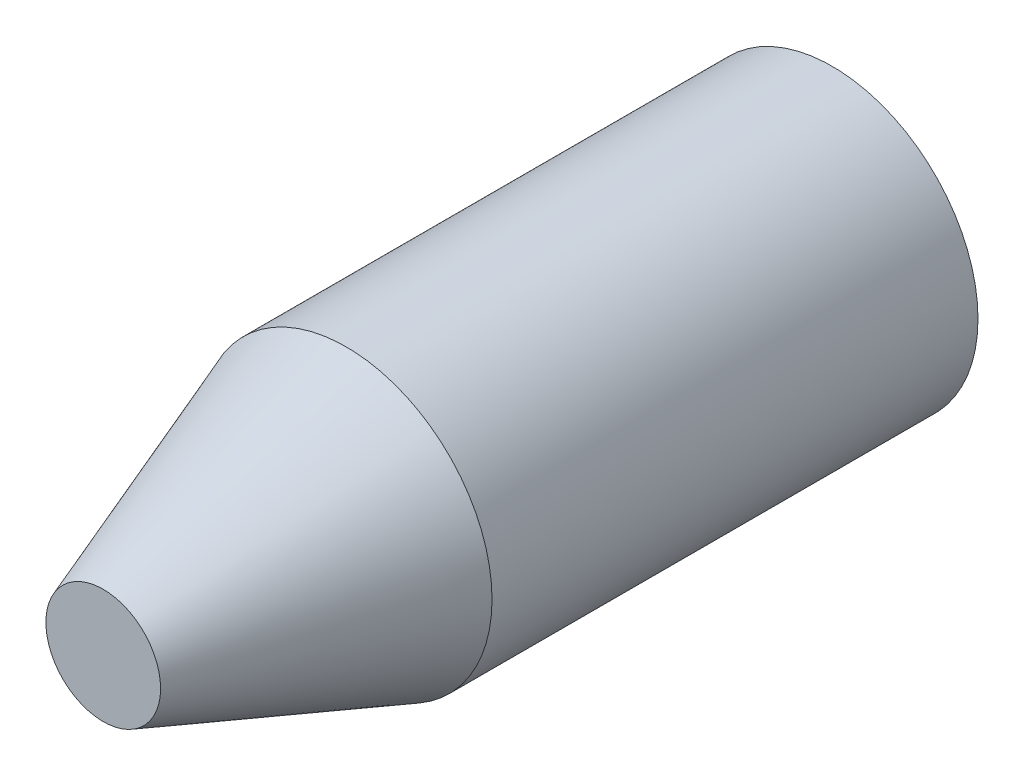
ISO-10303-21;
HEADER;
FILE_DESCRIPTION(('STEP AP214'),'2;1');
FILE_NAME('part.step','',(''),(''),'','','');
FILE_SCHEMA(('AUTOMOTIVE_DESIGN { 1 0 10303 214 1 1 1 1 }'));
ENDSEC;
DATA;
#1=APPLICATION_CONTEXT('core data for automotive mechanical design processes');
#2=APPLICATION_PROTOCOL_DEFINITION('international standard','automotive_design',2000,#1);
#3=PRODUCT_CONTEXT('',#1,'mechanical');
#4=PRODUCT('Part','Part','',(#3));
#5=PRODUCT_RELATED_PRODUCT_CATEGORY('part','',(#4));
#6=PRODUCT_DEFINITION_FORMATION('','',#4);
#7=PRODUCT_DEFINITION_CONTEXT('part definition',#1,'design');
#8=PRODUCT_DEFINITION('design','',#6,#7);
#9=PRODUCT_DEFINITION_SHAPE('','',#8);
#10=(LENGTH_UNIT() NAMED_UNIT(*) SI_UNIT(.MILLI.,.METRE.));
#11=(NAMED_UNIT(*) PLANE_ANGLE_UNIT() SI_UNIT($,.RADIAN.));
#12=(NAMED_UNIT(*) SI_UNIT($,.STERADIAN.) SOLID_ANGLE_UNIT());
#13=UNCERTAINTY_MEASURE_WITH_UNIT(LENGTH_MEASURE(1.E-05),#10,'distance_accuracy_value','');
#14=(GEOMETRIC_REPRESENTATION_CONTEXT(3) GLOBAL_UNCERTAINTY_ASSIGNED_CONTEXT((#13)) GLOBAL_UNIT_ASSIGNED_CONTEXT((#10,
#11,#12)) REPRESENTATION_CONTEXT('',''));
#15=CARTESIAN_POINT('',(0.,0.,0.));
#16=DIRECTION('',(0.,0.,1.));
#17=DIRECTION('',(1.,0.,0.));
#18=AXIS2_PLACEMENT_3D('',#15,#16,#17);
#19=CARTESIAN_POINT('',(0.,0.,10.));
#20=DIRECTION('',(0.,0.,-1.));
#21=DIRECTION('',(-1.,0.,0.));
#22=AXIS2_PLACEMENT_3D('',#19,#20,#21);
#23=CYLINDRICAL_SURFACE('',#22,3.);
#24=CARTESIAN_POINT('',(0.,0.,10.));
#25=DIRECTION('',(0.,0.,1.));
#26=DIRECTION('',(1.,0.,0.));
#27=AXIS2_PLACEMENT_3D('',#24,#25,#26);
#28=CIRCLE('',#27,3.);
#29=CARTESIAN_POINT('',(3.,0.,10.));
#30=VERTEX_POINT('',#29);
#31=EDGE_CURVE('E10',#30,#30,#28,.T.);
#32=ORIENTED_EDGE('',*,*,#31,.F.);
#33=EDGE_LOOP('',(#32));
#34=FACE_BOUND('',#33,.T.);
#35=CARTESIAN_POINT('',(0.,0.,0.));
#36=DIRECTION('',(0.,0.,1.));
#37=DIRECTION('',(1.,0.,0.));
#38=AXIS2_PLACEMENT_3D('',#35,#36,#37);
#39=CIRCLE('',#38,3.);
#40=CARTESIAN_POINT('',(3.,0.,0.));
#41=VERTEX_POINT('',#40);
#42=EDGE_CURVE('E33',#41,#41,#39,.T.);
#43=ORIENTED_EDGE('',*,*,#42,.T.);
#44=EDGE_LOOP('',(#43));
#45=FACE_BOUND('',#44,.T.);
#46=ADVANCED_FACE('F30',(#34,#45),#23,.T.);
#47=CARTESIAN_POINT('',(0.,0.,0.));
#48=DIRECTION('',(0.,0.,1.));
#49=DIRECTION('',(1.,0.,0.));
#50=AXIS2_PLACEMENT_3D('',#47,#48,#49);
#51=PLANE('',#50);
#52=ORIENTED_EDGE('',*,*,#42,.F.);
#53=EDGE_LOOP('',(#52));
#54=FACE_BOUND('',#53,.T.);
#55=ADVANCED_FACE('F49',(#54),#51,.F.);
#56=CARTESIAN_POINT('',(0.,0.,10.));
#57=DIRECTION('',(0.,0.,-1.));
#58=DIRECTION('',(1.,0.,0.));
#59=AXIS2_PLACEMENT_3D('',#56,#57,#58);
#60=CONICAL_SURFACE('',#59,3.,0.349065850398867);
#61=CARTESIAN_POINT('',(0.,0.,15.));
#62=DIRECTION('',(0.,0.,1.));
#63=DIRECTION('',(1.,0.,0.));
#64=AXIS2_PLACEMENT_3D('',#61,#62,#63);
#65=CIRCLE('',#64,1.18014882866898);
#66=CARTESIAN_POINT('',(1.18014882866898,0.,15.));
#67=VERTEX_POINT('',#66);
#68=EDGE_CURVE('E40',#67,#67,#65,.T.);
#69=ORIENTED_EDGE('',*,*,#68,.F.);
#70=EDGE_LOOP('',(#69));
#71=FACE_BOUND('',#70,.T.);
#72=ORIENTED_EDGE('',*,*,#31,.T.);
#73=EDGE_LOOP('',(#72));
#74=FACE_BOUND('',#73,.T.);
#75=ADVANCED_FACE('F47',(#71,#74),#60,.T.);
#76=CARTESIAN_POINT('',(0.,0.,15.));
#77=DIRECTION('',(0.,0.,1.));
#78=DIRECTION('',(1.,0.,0.));
#79=AXIS2_PLACEMENT_3D('',#76,#77,#78);
#80=PLANE('',#79);
#81=ORIENTED_EDGE('',*,*,#68,.T.);
#82=EDGE_LOOP('',(#81));
#83=FACE_BOUND('',#82,.T.);
#84=ADVANCED_FACE('F45',(#83),#80,.T.);
#85=CLOSED_SHELL('',(#46,#55,#75,#84));
#86=MANIFOLD_SOLID_BREP('B2',#85);
#87=ADVANCED_BREP_SHAPE_REPRESENTATION('',(#18,#86),#14);
#88=SHAPE_DEFINITION_REPRESENTATION(#9,#87);
ENDSEC;
END-ISO-10303-21;
